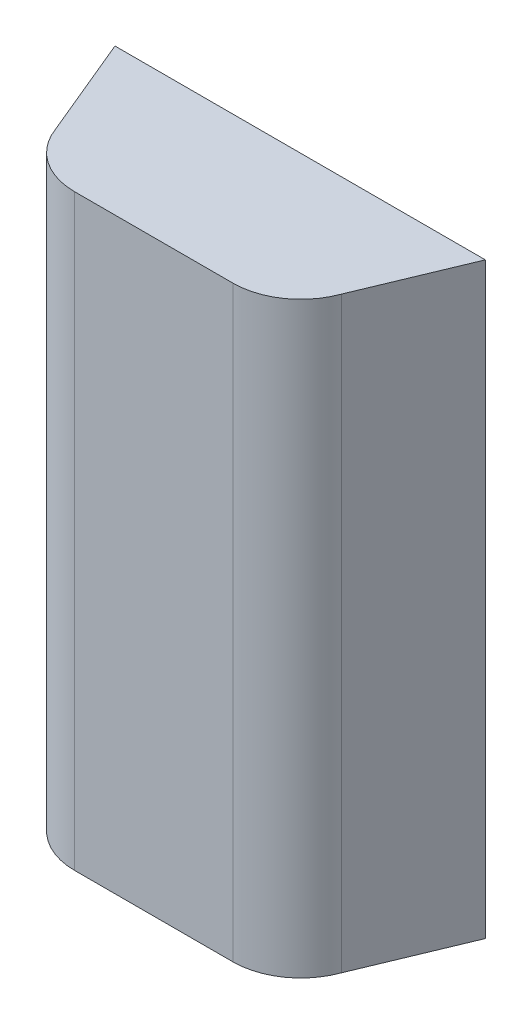
ISO-10303-21;
HEADER;
FILE_DESCRIPTION(('STEP AP214'),'2;1');
FILE_NAME('part.step','',(''),(''),'','','');
FILE_SCHEMA(('AUTOMOTIVE_DESIGN { 1 0 10303 214 1 1 1 1 }'));
ENDSEC;
DATA;
#1=APPLICATION_CONTEXT('core data for automotive mechanical design processes');
#2=APPLICATION_PROTOCOL_DEFINITION('international standard','automotive_design',2000,#1);
#3=PRODUCT_CONTEXT('',#1,'mechanical');
#4=PRODUCT('Part','Part','',(#3));
#5=PRODUCT_RELATED_PRODUCT_CATEGORY('part','',(#4));
#6=PRODUCT_DEFINITION_FORMATION('','',#4);
#7=PRODUCT_DEFINITION_CONTEXT('part definition',#1,'design');
#8=PRODUCT_DEFINITION('design','',#6,#7);
#9=PRODUCT_DEFINITION_SHAPE('','',#8);
#10=(LENGTH_UNIT() NAMED_UNIT(*) SI_UNIT(.MILLI.,.METRE.));
#11=(NAMED_UNIT(*) PLANE_ANGLE_UNIT() SI_UNIT($,.RADIAN.));
#12=(NAMED_UNIT(*) SI_UNIT($,.STERADIAN.) SOLID_ANGLE_UNIT());
#13=UNCERTAINTY_MEASURE_WITH_UNIT(LENGTH_MEASURE(1.E-05),#10,'distance_accuracy_value','');
#14=(GEOMETRIC_REPRESENTATION_CONTEXT(3) GLOBAL_UNCERTAINTY_ASSIGNED_CONTEXT((#13)) GLOBAL_UNIT_ASSIGNED_CONTEXT((#10,
#11,#12)) REPRESENTATION_CONTEXT('',''));
#15=CARTESIAN_POINT('',(0.,0.,0.));
#16=DIRECTION('',(0.,0.,1.));
#17=DIRECTION('',(1.,0.,0.));
#18=AXIS2_PLACEMENT_3D('',#15,#16,#17);
#19=CARTESIAN_POINT('',(-35.,260.,-30.));
#20=DIRECTION('',(0.,-1.,0.));
#21=DIRECTION('',(0.,0.,-1.));
#22=AXIS2_PLACEMENT_3D('',#19,#20,#21);
#23=CYLINDRICAL_SURFACE('',#22,30.);
#24=CARTESIAN_POINT('',(-35.,0.,-30.));
#25=DIRECTION('',(0.,1.,0.));
#26=DIRECTION('',(0.,0.,1.));
#27=AXIS2_PLACEMENT_3D('',#24,#25,#26);
#28=CIRCLE('',#27,30.);
#29=CARTESIAN_POINT('',(-63.1907786235773,0.,-19.73939570023));
#30=VERTEX_POINT('',#29);
#31=CARTESIAN_POINT('',(-35.,0.,0.));
#32=VERTEX_POINT('',#31);
#33=EDGE_CURVE('E131',#30,#32,#28,.T.);
#34=ORIENTED_EDGE('',*,*,#33,.T.);
#35=DIRECTION('',(0.,-1.,0.));
#36=VECTOR('',#35,1.);
#37=CARTESIAN_POINT('',(-35.,260.,0.));
#38=LINE('',#37,#36);
#39=CARTESIAN_POINT('',(-35.,260.,0.));
#40=VERTEX_POINT('',#39);
#41=EDGE_CURVE('E11',#40,#32,#38,.T.);
#42=ORIENTED_EDGE('',*,*,#41,.F.);
#43=CARTESIAN_POINT('',(-35.,260.,-30.));
#44=DIRECTION('',(0.,1.,0.));
#45=DIRECTION('',(0.,0.,1.));
#46=AXIS2_PLACEMENT_3D('',#43,#44,#45);
#47=CIRCLE('',#46,30.);
#48=CARTESIAN_POINT('',(-63.1907786235773,260.,-19.73939570023));
#49=VERTEX_POINT('',#48);
#50=EDGE_CURVE('E144',#49,#40,#47,.T.);
#51=ORIENTED_EDGE('',*,*,#50,.F.);
#52=DIRECTION('',(0.,-1.,0.));
#53=VECTOR('',#52,1.);
#54=CARTESIAN_POINT('',(-63.1907786235773,260.,-19.73939570023));
#55=LINE('',#54,#53);
#56=EDGE_CURVE('E127',#49,#30,#55,.T.);
#57=ORIENTED_EDGE('',*,*,#56,.T.);
#58=EDGE_LOOP('',(#34,#42,#51,#57));
#59=FACE_BOUND('',#58,.T.);
#60=ADVANCED_FACE('F33',(#59),#23,.T.);
#61=CARTESIAN_POINT('',(35.,260.,0.));
#62=DIRECTION('',(0.,0.,-1.));
#63=DIRECTION('',(-1.,0.,0.));
#64=AXIS2_PLACEMENT_3D('',#61,#62,#63);
#65=PLANE('',#64);
#66=DIRECTION('',(1.,0.,0.));
#67=VECTOR('',#66,1.);
#68=CARTESIAN_POINT('',(35.,0.,0.));
#69=LINE('',#68,#67);
#70=CARTESIAN_POINT('',(35.,0.,0.));
#71=VERTEX_POINT('',#70);
#72=EDGE_CURVE('E134',#32,#71,#69,.T.);
#73=ORIENTED_EDGE('',*,*,#72,.T.);
#74=DIRECTION('',(0.,-1.,0.));
#75=VECTOR('',#74,1.);
#76=CARTESIAN_POINT('',(35.,260.,0.));
#77=LINE('',#76,#75);
#78=CARTESIAN_POINT('',(35.,260.,0.));
#79=VERTEX_POINT('',#78);
#80=EDGE_CURVE('E40',#79,#71,#77,.T.);
#81=ORIENTED_EDGE('',*,*,#80,.F.);
#82=DIRECTION('',(1.,0.,0.));
#83=VECTOR('',#82,1.);
#84=CARTESIAN_POINT('',(35.,260.,0.));
#85=LINE('',#84,#83);
#86=EDGE_CURVE('E91',#40,#79,#85,.T.);
#87=ORIENTED_EDGE('',*,*,#86,.F.);
#88=ORIENTED_EDGE('',*,*,#41,.T.);
#89=EDGE_LOOP('',(#73,#81,#87,#88));
#90=FACE_BOUND('',#89,.T.);
#91=ADVANCED_FACE('F178',(#90),#65,.F.);
#92=CARTESIAN_POINT('',(35.,260.,-30.));
#93=DIRECTION('',(0.,-1.,0.));
#94=DIRECTION('',(0.,0.,-1.));
#95=AXIS2_PLACEMENT_3D('',#92,#93,#94);
#96=CYLINDRICAL_SURFACE('',#95,30.);
#97=CARTESIAN_POINT('',(35.,0.,-30.));
#98=DIRECTION('',(0.,1.,0.));
#99=DIRECTION('',(0.,0.,-1.));
#100=AXIS2_PLACEMENT_3D('',#97,#98,#99);
#101=CIRCLE('',#100,30.);
#102=CARTESIAN_POINT('',(63.1907786235773,0.,-19.73939570023));
#103=VERTEX_POINT('',#102);
#104=EDGE_CURVE('E137',#71,#103,#101,.T.);
#105=ORIENTED_EDGE('',*,*,#104,.T.);
#106=DIRECTION('',(0.,-1.,0.));
#107=VECTOR('',#106,1.);
#108=CARTESIAN_POINT('',(63.1907786235773,260.,-19.73939570023));
#109=LINE('',#108,#107);
#110=CARTESIAN_POINT('',(63.1907786235773,260.,-19.73939570023));
#111=VERTEX_POINT('',#110);
#112=EDGE_CURVE('E121',#111,#103,#109,.T.);
#113=ORIENTED_EDGE('',*,*,#112,.F.);
#114=CARTESIAN_POINT('',(35.,260.,-30.));
#115=DIRECTION('',(0.,1.,0.));
#116=DIRECTION('',(0.,0.,-1.));
#117=AXIS2_PLACEMENT_3D('',#114,#115,#116);
#118=CIRCLE('',#117,30.);
#119=EDGE_CURVE('E108',#79,#111,#118,.T.);
#120=ORIENTED_EDGE('',*,*,#119,.F.);
#121=ORIENTED_EDGE('',*,*,#80,.T.);
#122=EDGE_LOOP('',(#105,#113,#120,#121));
#123=FACE_BOUND('',#122,.T.);
#124=ADVANCED_FACE('F150',(#123),#96,.T.);
#125=CARTESIAN_POINT('',(81.9087136929461,260.,-64.73939570023));
#126=DIRECTION('',(-0.923310329831069,0.,-0.384054728947898));
#127=DIRECTION('',(-0.384054728947898,0.,0.923310329831069));
#128=AXIS2_PLACEMENT_3D('',#125,#126,#127);
#129=PLANE('',#128);
#130=DIRECTION('',(0.384054728947898,0.,-0.923310329831069));
#131=VECTOR('',#130,1.);
#132=CARTESIAN_POINT('',(81.9087136929461,0.,-64.73939570023));
#133=LINE('',#132,#131);
#134=CARTESIAN_POINT('',(81.9087136929461,0.,-64.73939570023));
#135=VERTEX_POINT('',#134);
#136=EDGE_CURVE('E117',#103,#135,#133,.T.);
#137=ORIENTED_EDGE('',*,*,#136,.T.);
#138=DIRECTION('',(0.,-1.,0.));
#139=VECTOR('',#138,1.);
#140=CARTESIAN_POINT('',(81.9087136929461,260.,-64.73939570023));
#141=LINE('',#140,#139);
#142=CARTESIAN_POINT('',(81.9087136929461,260.,-64.73939570023));
#143=VERTEX_POINT('',#142);
#144=EDGE_CURVE('E114',#143,#135,#141,.T.);
#145=ORIENTED_EDGE('',*,*,#144,.F.);
#146=DIRECTION('',(0.384054728947898,0.,-0.923310329831069));
#147=VECTOR('',#146,1.);
#148=CARTESIAN_POINT('',(81.9087136929461,260.,-64.73939570023));
#149=LINE('',#148,#147);
#150=EDGE_CURVE('E101',#111,#143,#149,.T.);
#151=ORIENTED_EDGE('',*,*,#150,.F.);
#152=ORIENTED_EDGE('',*,*,#112,.T.);
#153=EDGE_LOOP('',(#137,#145,#151,#152));
#154=FACE_BOUND('',#153,.T.);
#155=ADVANCED_FACE('F115',(#154),#129,.F.);
#156=CARTESIAN_POINT('',(-81.9087136929461,260.,-64.73939570023));
#157=DIRECTION('',(0.,0.,1.));
#158=DIRECTION('',(1.,0.,0.));
#159=AXIS2_PLACEMENT_3D('',#156,#157,#158);
#160=PLANE('',#159);
#161=DIRECTION('',(1.,0.,0.));
#162=VECTOR('',#161,1.);
#163=CARTESIAN_POINT('',(-78.9087136929462,256.,-64.73939570023));
#164=LINE('',#163,#162);
#165=CARTESIAN_POINT('',(-78.9087136929462,256.,-64.73939570023));
#166=VERTEX_POINT('',#165);
#167=CARTESIAN_POINT('',(78.9087136929462,256.,-64.73939570023));
#168=VERTEX_POINT('',#167);
#169=EDGE_CURVE('E161',#166,#168,#164,.T.);
#170=ORIENTED_EDGE('',*,*,#169,.F.);
#171=DIRECTION('',(0.,-1.,0.));
#172=VECTOR('',#171,1.);
#173=CARTESIAN_POINT('',(-78.9087136929462,256.,-64.73939570023));
#174=LINE('',#173,#172);
#175=CARTESIAN_POINT('',(-78.9087136929462,0.,-64.73939570023));
#176=VERTEX_POINT('',#175);
#177=EDGE_CURVE('E165',#166,#176,#174,.T.);
#178=ORIENTED_EDGE('',*,*,#177,.T.);
#179=DIRECTION('',(-1.,0.,0.));
#180=VECTOR('',#179,1.);
#181=CARTESIAN_POINT('',(-81.9087136929461,0.,-64.73939570023));
#182=LINE('',#181,#180);
#183=CARTESIAN_POINT('',(-81.9087136929461,0.,-64.73939570023));
#184=VERTEX_POINT('',#183);
#185=EDGE_CURVE('E140',#176,#184,#182,.T.);
#186=ORIENTED_EDGE('',*,*,#185,.T.);
#187=DIRECTION('',(0.,-1.,0.));
#188=VECTOR('',#187,1.);
#189=CARTESIAN_POINT('',(-81.9087136929461,260.,-64.73939570023));
#190=LINE('',#189,#188);
#191=CARTESIAN_POINT('',(-81.9087136929461,260.,-64.73939570023));
#192=VERTEX_POINT('',#191);
#193=EDGE_CURVE('E122',#192,#184,#190,.T.);
#194=ORIENTED_EDGE('',*,*,#193,.F.);
#195=DIRECTION('',(-1.,0.,0.));
#196=VECTOR('',#195,1.);
#197=CARTESIAN_POINT('',(-81.9087136929461,260.,-64.73939570023));
#198=LINE('',#197,#196);
#199=EDGE_CURVE('E105',#143,#192,#198,.T.);
#200=ORIENTED_EDGE('',*,*,#199,.F.);
#201=ORIENTED_EDGE('',*,*,#144,.T.);
#202=CARTESIAN_POINT('',(78.9087136929462,0.,-64.73939570023));
#203=VERTEX_POINT('',#202);
#204=EDGE_CURVE('E141',#135,#203,#182,.T.);
#205=ORIENTED_EDGE('',*,*,#204,.T.);
#206=DIRECTION('',(0.,-1.,0.));
#207=VECTOR('',#206,1.);
#208=CARTESIAN_POINT('',(78.9087136929462,256.,-64.73939570023));
#209=LINE('',#208,#207);
#210=EDGE_CURVE('E47',#168,#203,#209,.T.);
#211=ORIENTED_EDGE('',*,*,#210,.F.);
#212=EDGE_LOOP('',(#170,#178,#186,#194,#200,#201,#205,#211));
#213=FACE_BOUND('',#212,.T.);
#214=ADVANCED_FACE('F125',(#213),#160,.F.);
#215=CARTESIAN_POINT('',(-81.9087136929461,260.,-64.73939570023));
#216=DIRECTION('',(0.923310329831069,0.,-0.384054728947898));
#217=DIRECTION('',(-0.384054728947898,0.,-0.923310329831069));
#218=AXIS2_PLACEMENT_3D('',#215,#216,#217);
#219=PLANE('',#218);
#220=DIRECTION('',(0.384054728947898,0.,0.923310329831069));
#221=VECTOR('',#220,1.);
#222=CARTESIAN_POINT('',(-81.9087136929461,0.,-64.73939570023));
#223=LINE('',#222,#221);
#224=EDGE_CURVE('E83',#184,#30,#223,.T.);
#225=ORIENTED_EDGE('',*,*,#224,.T.);
#226=ORIENTED_EDGE('',*,*,#56,.F.);
#227=DIRECTION('',(0.384054728947898,0.,0.923310329831069));
#228=VECTOR('',#227,1.);
#229=CARTESIAN_POINT('',(-81.9087136929461,260.,-64.73939570023));
#230=LINE('',#229,#228);
#231=EDGE_CURVE('E56',#192,#49,#230,.T.);
#232=ORIENTED_EDGE('',*,*,#231,.F.);
#233=ORIENTED_EDGE('',*,*,#193,.T.);
#234=EDGE_LOOP('',(#225,#226,#232,#233));
#235=FACE_BOUND('',#234,.T.);
#236=ADVANCED_FACE('F190',(#235),#219,.F.);
#237=CARTESIAN_POINT('',(-35.,260.,-30.));
#238=DIRECTION('',(0.,1.,0.));
#239=DIRECTION('',(0.,0.,1.));
#240=AXIS2_PLACEMENT_3D('',#237,#238,#239);
#241=PLANE('',#240);
#242=ORIENTED_EDGE('',*,*,#50,.T.);
#243=ORIENTED_EDGE('',*,*,#86,.T.);
#244=ORIENTED_EDGE('',*,*,#119,.T.);
#245=ORIENTED_EDGE('',*,*,#150,.T.);
#246=ORIENTED_EDGE('',*,*,#199,.T.);
#247=ORIENTED_EDGE('',*,*,#231,.T.);
#248=EDGE_LOOP('',(#242,#243,#244,#245,#246,#247));
#249=FACE_BOUND('',#248,.T.);
#250=ADVANCED_FACE('F103',(#249),#241,.T.);
#251=CARTESIAN_POINT('',(-35.,0.,-30.));
#252=DIRECTION('',(0.,1.,0.));
#253=DIRECTION('',(0.,0.,1.));
#254=AXIS2_PLACEMENT_3D('',#251,#252,#253);
#255=PLANE('',#254);
#256=ORIENTED_EDGE('',*,*,#185,.F.);
#257=DIRECTION('',(-0.388514258829521,0.,-0.921442711559513));
#258=VECTOR('',#257,1.);
#259=CARTESIAN_POINT('',(-60.7888694367235,0.,-21.7644004586366));
#260=LINE('',#259,#258);
#261=CARTESIAN_POINT('',(-60.7888694367235,0.,-21.7644004586366));
#262=VERTEX_POINT('',#261);
#263=EDGE_CURVE('E233',#262,#176,#260,.T.);
#264=ORIENTED_EDGE('',*,*,#263,.F.);
#265=CARTESIAN_POINT('',(-35.,0.,-3.));
#266=CARTESIAN_POINT('',(-54.7695230961748,0.,-6.84226263463311));
#267=CARTESIAN_POINT('',(-60.7888694367235,0.,-21.7644004586366));
#268=B_SPLINE_CURVE_WITH_KNOTS('',2,(#265,#266,#267),.UNSPECIFIED.,.F.,.F.,(3,3),(0.,1.),.UNSPECIFIED.);
#269=CARTESIAN_POINT('',(-35.,0.,-3.));
#270=VERTEX_POINT('',#269);
#271=EDGE_CURVE('E253',#270,#262,#268,.T.);
#272=ORIENTED_EDGE('',*,*,#271,.F.);
#273=DIRECTION('',(-1.,0.,0.));
#274=VECTOR('',#273,1.);
#275=CARTESIAN_POINT('',(-35.,0.,-3.));
#276=LINE('',#275,#274);
#277=CARTESIAN_POINT('',(35.,0.,-3.));
#278=VERTEX_POINT('',#277);
#279=EDGE_CURVE('E256',#278,#270,#276,.T.);
#280=ORIENTED_EDGE('',*,*,#279,.F.);
#281=CARTESIAN_POINT('',(60.7888694367235,0.,-21.7644004586366));
#282=CARTESIAN_POINT('',(54.7695230961747,0.,-6.84226263463312));
#283=CARTESIAN_POINT('',(35.,0.,-3.));
#284=B_SPLINE_CURVE_WITH_KNOTS('',2,(#281,#282,#283),.UNSPECIFIED.,.F.,.F.,(3,3),(0.,1.),.UNSPECIFIED.);
#285=CARTESIAN_POINT('',(60.7888694367235,0.,-21.7644004586366));
#286=VERTEX_POINT('',#285);
#287=EDGE_CURVE('E263',#286,#278,#284,.T.);
#288=ORIENTED_EDGE('',*,*,#287,.F.);
#289=DIRECTION('',(-0.388514258829521,0.,0.921442711559513));
#290=VECTOR('',#289,1.);
#291=CARTESIAN_POINT('',(60.7888694367235,0.,-21.7644004586366));
#292=LINE('',#291,#290);
#293=EDGE_CURVE('E156',#203,#286,#292,.T.);
#294=ORIENTED_EDGE('',*,*,#293,.F.);
#295=ORIENTED_EDGE('',*,*,#204,.F.);
#296=ORIENTED_EDGE('',*,*,#136,.F.);
#297=ORIENTED_EDGE('',*,*,#104,.F.);
#298=ORIENTED_EDGE('',*,*,#72,.F.);
#299=ORIENTED_EDGE('',*,*,#33,.F.);
#300=ORIENTED_EDGE('',*,*,#224,.F.);
#301=EDGE_LOOP('',(#256,#264,#272,#280,#288,#294,#295,#296,#297,#298,#299,#300));
#302=FACE_BOUND('',#301,.T.);
#303=ADVANCED_FACE('F153',(#302),#255,.F.);
#304=CARTESIAN_POINT('',(-60.7888694367235,256.,-21.7644004586366));
#305=DIRECTION('',(-0.921442711559513,0.,0.388514258829521));
#306=DIRECTION('',(0.388514258829521,0.,0.921442711559513));
#307=AXIS2_PLACEMENT_3D('',#304,#305,#306);
#308=PLANE('',#307);
#309=ORIENTED_EDGE('',*,*,#263,.T.);
#310=ORIENTED_EDGE('',*,*,#177,.F.);
#311=DIRECTION('',(-0.388514258829521,0.,-0.921442711559513));
#312=VECTOR('',#311,1.);
#313=CARTESIAN_POINT('',(-60.7888694367235,256.,-21.7644004586366));
#314=LINE('',#313,#312);
#315=CARTESIAN_POINT('',(-60.7888694367235,256.,-21.7644004586366));
#316=VERTEX_POINT('',#315);
#317=EDGE_CURVE('E247',#316,#166,#314,.T.);
#318=ORIENTED_EDGE('',*,*,#317,.F.);
#319=DIRECTION('',(0.,-1.,0.));
#320=VECTOR('',#319,1.);
#321=CARTESIAN_POINT('',(-60.7888694367235,256.,-21.7644004586366));
#322=LINE('',#321,#320);
#323=EDGE_CURVE('E135',#316,#262,#322,.T.);
#324=ORIENTED_EDGE('',*,*,#323,.T.);
#325=EDGE_LOOP('',(#309,#310,#318,#324));
#326=FACE_BOUND('',#325,.T.);
#327=ADVANCED_FACE('F195',(#326),#308,.F.);
#328=CARTESIAN_POINT('',(-35.,256.,-3.));
#329=CARTESIAN_POINT('',(-54.7695230961748,256.,-6.84226263463311));
#330=CARTESIAN_POINT('',(-60.7888694367235,256.,-21.7644004586366));
#331=B_SPLINE_CURVE_WITH_KNOTS('',2,(#328,#329,#330),.UNSPECIFIED.,.F.,.F.,(3,3),(0.,1.),.UNSPECIFIED.);
#332=DIRECTION('',(0.,-1.,0.));
#333=VECTOR('',#332,1.);
#334=SURFACE_OF_LINEAR_EXTRUSION('',#331,#333);
#335=ORIENTED_EDGE('',*,*,#271,.T.);
#336=ORIENTED_EDGE('',*,*,#323,.F.);
#337=CARTESIAN_POINT('',(-35.,256.,-3.));
#338=VERTEX_POINT('',#337);
#339=EDGE_CURVE('E170',#338,#316,#331,.T.);
#340=ORIENTED_EDGE('',*,*,#339,.F.);
#341=DIRECTION('',(0.,-1.,0.));
#342=VECTOR('',#341,1.);
#343=CARTESIAN_POINT('',(-35.,256.,-3.));
#344=LINE('',#343,#342);
#345=EDGE_CURVE('E273',#338,#270,#344,.T.);
#346=ORIENTED_EDGE('',*,*,#345,.T.);
#347=EDGE_LOOP('',(#335,#336,#340,#346));
#348=FACE_BOUND('',#347,.T.);
#349=ADVANCED_FACE('F200',(#348),#334,.F.);
#350=CARTESIAN_POINT('',(-35.,256.,-3.));
#351=DIRECTION('',(0.,0.,1.));
#352=DIRECTION('',(1.,0.,0.));
#353=AXIS2_PLACEMENT_3D('',#350,#351,#352);
#354=PLANE('',#353);
#355=ORIENTED_EDGE('',*,*,#279,.T.);
#356=ORIENTED_EDGE('',*,*,#345,.F.);
#357=DIRECTION('',(-1.,0.,0.));
#358=VECTOR('',#357,1.);
#359=CARTESIAN_POINT('',(-35.,256.,-3.));
#360=LINE('',#359,#358);
#361=CARTESIAN_POINT('',(35.,256.,-3.));
#362=VERTEX_POINT('',#361);
#363=EDGE_CURVE('E220',#362,#338,#360,.T.);
#364=ORIENTED_EDGE('',*,*,#363,.F.);
#365=DIRECTION('',(0.,-1.,0.));
#366=VECTOR('',#365,1.);
#367=CARTESIAN_POINT('',(35.,256.,-3.));
#368=LINE('',#367,#366);
#369=EDGE_CURVE('E168',#362,#278,#368,.T.);
#370=ORIENTED_EDGE('',*,*,#369,.T.);
#371=EDGE_LOOP('',(#355,#356,#364,#370));
#372=FACE_BOUND('',#371,.T.);
#373=ADVANCED_FACE('F210',(#372),#354,.F.);
#374=CARTESIAN_POINT('',(60.7888694367235,256.,-21.7644004586366));
#375=CARTESIAN_POINT('',(54.7695230961747,256.,-6.84226263463312));
#376=CARTESIAN_POINT('',(35.,256.,-3.));
#377=B_SPLINE_CURVE_WITH_KNOTS('',2,(#374,#375,#376),.UNSPECIFIED.,.F.,.F.,(3,3),(0.,1.),.UNSPECIFIED.);
#378=DIRECTION('',(0.,-1.,0.));
#379=VECTOR('',#378,1.);
#380=SURFACE_OF_LINEAR_EXTRUSION('',#377,#379);
#381=ORIENTED_EDGE('',*,*,#287,.T.);
#382=ORIENTED_EDGE('',*,*,#369,.F.);
#383=CARTESIAN_POINT('',(60.7888694367235,256.,-21.7644004586366));
#384=VERTEX_POINT('',#383);
#385=EDGE_CURVE('E213',#384,#362,#377,.T.);
#386=ORIENTED_EDGE('',*,*,#385,.F.);
#387=DIRECTION('',(0.,-1.,0.));
#388=VECTOR('',#387,1.);
#389=CARTESIAN_POINT('',(60.7888694367235,256.,-21.7644004586366));
#390=LINE('',#389,#388);
#391=EDGE_CURVE('E164',#384,#286,#390,.T.);
#392=ORIENTED_EDGE('',*,*,#391,.T.);
#393=EDGE_LOOP('',(#381,#382,#386,#392));
#394=FACE_BOUND('',#393,.T.);
#395=ADVANCED_FACE('F206',(#394),#380,.F.);
#396=CARTESIAN_POINT('',(60.7888694367235,256.,-21.7644004586366));
#397=DIRECTION('',(0.921442711559513,0.,0.388514258829521));
#398=DIRECTION('',(0.388514258829521,0.,-0.921442711559513));
#399=AXIS2_PLACEMENT_3D('',#396,#397,#398);
#400=PLANE('',#399);
#401=ORIENTED_EDGE('',*,*,#293,.T.);
#402=ORIENTED_EDGE('',*,*,#391,.F.);
#403=DIRECTION('',(-0.388514258829521,0.,0.921442711559513));
#404=VECTOR('',#403,1.);
#405=CARTESIAN_POINT('',(60.7888694367235,256.,-21.7644004586366));
#406=LINE('',#405,#404);
#407=EDGE_CURVE('E221',#168,#384,#406,.T.);
#408=ORIENTED_EDGE('',*,*,#407,.F.);
#409=ORIENTED_EDGE('',*,*,#210,.T.);
#410=EDGE_LOOP('',(#401,#402,#408,#409));
#411=FACE_BOUND('',#410,.T.);
#412=ADVANCED_FACE('F202',(#411),#400,.F.);
#413=CARTESIAN_POINT('',(51.3319789072682,256.,-9.61223143197571));
#414=DIRECTION('',(0.,-1.,0.));
#415=DIRECTION('',(0.,0.,-1.));
#416=AXIS2_PLACEMENT_3D('',#413,#414,#415);
#417=PLANE('',#416);
#418=ORIENTED_EDGE('',*,*,#317,.T.);
#419=ORIENTED_EDGE('',*,*,#169,.T.);
#420=ORIENTED_EDGE('',*,*,#407,.T.);
#421=ORIENTED_EDGE('',*,*,#385,.T.);
#422=ORIENTED_EDGE('',*,*,#363,.T.);
#423=ORIENTED_EDGE('',*,*,#339,.T.);
#424=EDGE_LOOP('',(#418,#419,#420,#421,#422,#423));
#425=FACE_BOUND('',#424,.T.);
#426=ADVANCED_FACE('F205',(#425),#417,.T.);
#427=CLOSED_SHELL('',(#60,#91,#124,#155,#214,#236,#250,#303,#327,#349,#373,#395,#412,#426));
#428=MANIFOLD_SOLID_BREP('B2',#427);
#429=ADVANCED_BREP_SHAPE_REPRESENTATION('',(#18,#428),#14);
#430=SHAPE_DEFINITION_REPRESENTATION(#9,#429);
ENDSEC;
END-ISO-10303-21;
